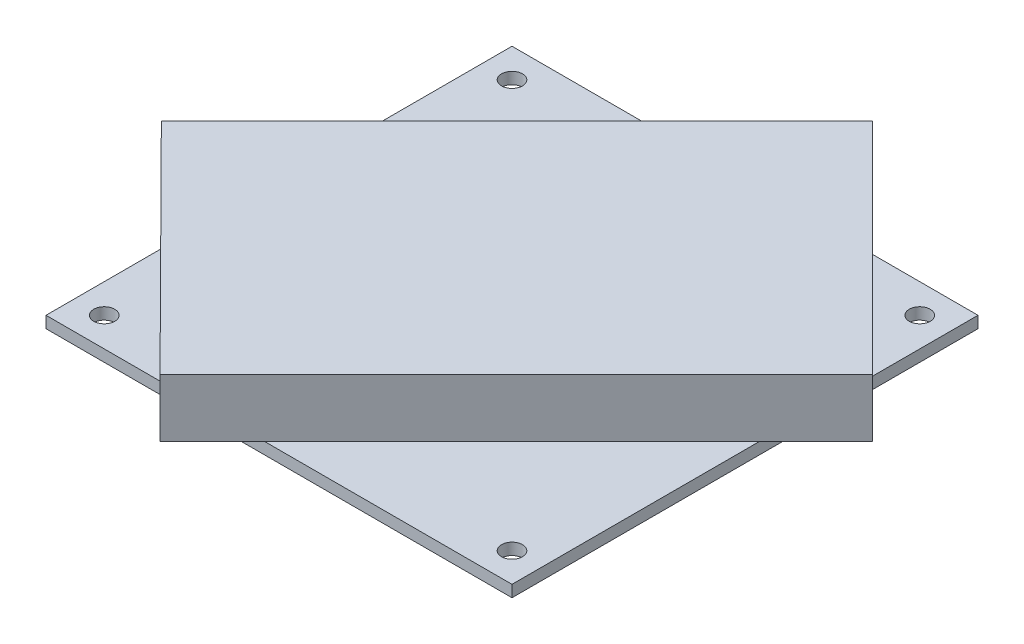
ISO-10303-21;
HEADER;
FILE_DESCRIPTION(('STEP AP214'),'2;1');
FILE_NAME('part.step','',(''),(''),'','','');
FILE_SCHEMA(('AUTOMOTIVE_DESIGN { 1 0 10303 214 1 1 1 1 }'));
ENDSEC;
DATA;
#1=APPLICATION_CONTEXT('core data for automotive mechanical design processes');
#2=APPLICATION_PROTOCOL_DEFINITION('international standard','automotive_design',2000,#1);
#3=PRODUCT_CONTEXT('',#1,'mechanical');
#4=PRODUCT('Part','Part','',(#3));
#5=PRODUCT_RELATED_PRODUCT_CATEGORY('part','',(#4));
#6=PRODUCT_DEFINITION_FORMATION('','',#4);
#7=PRODUCT_DEFINITION_CONTEXT('part definition',#1,'design');
#8=PRODUCT_DEFINITION('design','',#6,#7);
#9=PRODUCT_DEFINITION_SHAPE('','',#8);
#10=(LENGTH_UNIT() NAMED_UNIT(*) SI_UNIT(.MILLI.,.METRE.));
#11=(NAMED_UNIT(*) PLANE_ANGLE_UNIT() SI_UNIT($,.RADIAN.));
#12=(NAMED_UNIT(*) SI_UNIT($,.STERADIAN.) SOLID_ANGLE_UNIT());
#13=UNCERTAINTY_MEASURE_WITH_UNIT(LENGTH_MEASURE(1.E-05),#10,'distance_accuracy_value','');
#14=(GEOMETRIC_REPRESENTATION_CONTEXT(3) GLOBAL_UNCERTAINTY_ASSIGNED_CONTEXT((#13)) GLOBAL_UNIT_ASSIGNED_CONTEXT((#10,
#11,#12)) REPRESENTATION_CONTEXT('',''));
#15=CARTESIAN_POINT('',(0.,0.,0.));
#16=DIRECTION('',(0.,0.,1.));
#17=DIRECTION('',(1.,0.,0.));
#18=AXIS2_PLACEMENT_3D('',#15,#16,#17);
#19=CARTESIAN_POINT('',(0.,2.,0.));
#20=DIRECTION('',(0.,-1.,0.));
#21=DIRECTION('',(0.,0.,-1.));
#22=AXIS2_PLACEMENT_3D('',#19,#20,#21);
#23=PLANE('',#22);
#24=CARTESIAN_POINT('',(5.,2.,-4.99999999999999));
#25=DIRECTION('',(0.,1.,0.));
#26=DIRECTION('',(0.,0.,1.));
#27=AXIS2_PLACEMENT_3D('',#24,#25,#26);
#28=CIRCLE('',#27,1.8);
#29=CARTESIAN_POINT('',(5.,2.,-3.19999999999999));
#30=VERTEX_POINT('',#29);
#31=EDGE_CURVE('E210',#30,#30,#28,.T.);
#32=ORIENTED_EDGE('',*,*,#31,.F.);
#33=EDGE_LOOP('',(#32));
#34=FACE_BOUND('',#33,.T.);
#35=DIRECTION('',(0.705000654457306,0.,0.7092066533915));
#36=VECTOR('',#35,1.);
#37=CARTESIAN_POINT('',(-9.,2.,-28.8007146257669));
#38=LINE('',#37,#36);
#39=CARTESIAN_POINT('',(0.,2.,-19.7470210721958));
#40=VERTEX_POINT('',#39);
#41=CARTESIAN_POINT('',(19.6299100028256,2.,0.));
#42=VERTEX_POINT('',#41);
#43=EDGE_CURVE('E11',#40,#42,#38,.T.);
#44=ORIENTED_EDGE('',*,*,#43,.F.);
#45=DIRECTION('',(0.,0.,1.));
#46=VECTOR('',#45,1.);
#47=CARTESIAN_POINT('',(0.,2.,0.));
#48=LINE('',#47,#46);
#49=CARTESIAN_POINT('',(0.,2.,0.));
#50=VERTEX_POINT('',#49);
#51=EDGE_CURVE('E175',#40,#50,#48,.T.);
#52=ORIENTED_EDGE('',*,*,#51,.T.);
#53=DIRECTION('',(1.,0.,0.));
#54=VECTOR('',#53,1.);
#55=CARTESIAN_POINT('',(0.,2.,0.));
#56=LINE('',#55,#54);
#57=EDGE_CURVE('E176',#50,#42,#56,.T.);
#58=ORIENTED_EDGE('',*,*,#57,.T.);
#59=EDGE_LOOP('',(#44,#52,#58));
#60=FACE_BOUND('',#59,.T.);
#61=ADVANCED_FACE('F33',(#34,#60),#23,.F.);
#62=CARTESIAN_POINT('',(5.,2.,-75.));
#63=DIRECTION('',(0.,1.,0.));
#64=DIRECTION('',(0.,0.,1.));
#65=AXIS2_PLACEMENT_3D('',#62,#63,#64);
#66=CIRCLE('',#65,1.8);
#67=CARTESIAN_POINT('',(5.,2.,-73.2));
#68=VERTEX_POINT('',#67);
#69=EDGE_CURVE('E164',#68,#68,#66,.T.);
#70=ORIENTED_EDGE('',*,*,#69,.F.);
#71=EDGE_LOOP('',(#70));
#72=FACE_BOUND('',#71,.T.);
#73=DIRECTION('',(-0.707106781186546,0.,0.707106781186549));
#74=VECTOR('',#73,1.);
#75=CARTESIAN_POINT('',(-9.,2.,-28.8007146257669));
#76=LINE('',#75,#74);
#77=CARTESIAN_POINT('',(42.1992853742329,2.,-80.));
#78=VERTEX_POINT('',#77);
#79=CARTESIAN_POINT('',(0.,2.,-37.800714625767));
#80=VERTEX_POINT('',#79);
#81=EDGE_CURVE('E42',#78,#80,#76,.T.);
#82=ORIENTED_EDGE('',*,*,#81,.F.);
#83=DIRECTION('',(-1.,0.,0.));
#84=VECTOR('',#83,1.);
#85=CARTESIAN_POINT('',(0.,2.,-80.));
#86=LINE('',#85,#84);
#87=CARTESIAN_POINT('',(0.,2.,-80.));
#88=VERTEX_POINT('',#87);
#89=EDGE_CURVE('E183',#78,#88,#86,.T.);
#90=ORIENTED_EDGE('',*,*,#89,.T.);
#91=EDGE_CURVE('E171',#88,#80,#48,.T.);
#92=ORIENTED_EDGE('',*,*,#91,.T.);
#93=EDGE_LOOP('',(#82,#90,#92));
#94=FACE_BOUND('',#93,.T.);
#95=ADVANCED_FACE('F252',(#72,#94),#23,.F.);
#96=CARTESIAN_POINT('',(75.,2.,-75.));
#97=DIRECTION('',(0.,1.,0.));
#98=DIRECTION('',(0.,0.,1.));
#99=AXIS2_PLACEMENT_3D('',#96,#97,#98);
#100=CIRCLE('',#99,1.8);
#101=CARTESIAN_POINT('',(75.,2.,-73.2));
#102=VERTEX_POINT('',#101);
#103=EDGE_CURVE('E156',#102,#102,#100,.T.);
#104=ORIENTED_EDGE('',*,*,#103,.F.);
#105=EDGE_LOOP('',(#104));
#106=FACE_BOUND('',#105,.T.);
#107=DIRECTION('',(-0.707106781186547,0.,-0.707106781186547));
#108=VECTOR('',#107,1.);
#109=CARTESIAN_POINT('',(52.0233152163989,2.,-89.8240298421661));
#110=LINE('',#109,#108);
#111=CARTESIAN_POINT('',(80.,2.,-61.8473450585651));
#112=VERTEX_POINT('',#111);
#113=CARTESIAN_POINT('',(61.8473450585651,2.,-80.));
#114=VERTEX_POINT('',#113);
#115=EDGE_CURVE('E221',#112,#114,#110,.T.);
#116=ORIENTED_EDGE('',*,*,#115,.F.);
#117=DIRECTION('',(0.,0.,-1.));
#118=VECTOR('',#117,1.);
#119=CARTESIAN_POINT('',(80.,2.,0.));
#120=LINE('',#119,#118);
#121=CARTESIAN_POINT('',(80.,2.,-80.));
#122=VERTEX_POINT('',#121);
#123=EDGE_CURVE('E179',#112,#122,#120,.T.);
#124=ORIENTED_EDGE('',*,*,#123,.T.);
#125=EDGE_CURVE('E185',#122,#114,#86,.T.);
#126=ORIENTED_EDGE('',*,*,#125,.T.);
#127=EDGE_LOOP('',(#116,#124,#126));
#128=FACE_BOUND('',#127,.T.);
#129=ADVANCED_FACE('F303',(#106,#128),#23,.F.);
#130=CARTESIAN_POINT('',(75.,2.,-4.99999999999999));
#131=DIRECTION('',(0.,1.,0.));
#132=DIRECTION('',(0.,0.,1.));
#133=AXIS2_PLACEMENT_3D('',#130,#131,#132);
#134=CIRCLE('',#133,1.8);
#135=CARTESIAN_POINT('',(75.,2.,-3.19999999999999));
#136=VERTEX_POINT('',#135);
#137=EDGE_CURVE('E37',#136,#136,#134,.T.);
#138=ORIENTED_EDGE('',*,*,#137,.F.);
#139=EDGE_LOOP('',(#138));
#140=FACE_BOUND('',#139,.T.);
#141=DIRECTION('',(0.707106781186547,0.,-0.707106781186548));
#142=VECTOR('',#141,1.);
#143=CARTESIAN_POINT('',(28.5765348825744,2.,9.));
#144=LINE('',#143,#142);
#145=CARTESIAN_POINT('',(37.5765348825744,2.,0.));
#146=VERTEX_POINT('',#145);
#147=CARTESIAN_POINT('',(80.,2.,-42.4234651174256));
#148=VERTEX_POINT('',#147);
#149=EDGE_CURVE('E217',#146,#148,#144,.T.);
#150=ORIENTED_EDGE('',*,*,#149,.F.);
#151=CARTESIAN_POINT('',(80.,2.,0.));
#152=VERTEX_POINT('',#151);
#153=EDGE_CURVE('E173',#146,#152,#56,.T.);
#154=ORIENTED_EDGE('',*,*,#153,.T.);
#155=EDGE_CURVE('E181',#152,#148,#120,.T.);
#156=ORIENTED_EDGE('',*,*,#155,.T.);
#157=EDGE_LOOP('',(#150,#154,#156));
#158=FACE_BOUND('',#157,.T.);
#159=ADVANCED_FACE('F282',(#140,#158),#23,.F.);
#160=CARTESIAN_POINT('',(0.,2.,0.));
#161=DIRECTION('',(1.,0.,0.));
#162=DIRECTION('',(0.,0.,-1.));
#163=AXIS2_PLACEMENT_3D('',#160,#161,#162);
#164=PLANE('',#163);
#165=DIRECTION('',(0.,0.,1.));
#166=VECTOR('',#165,1.);
#167=CARTESIAN_POINT('',(0.,0.,0.));
#168=LINE('',#167,#166);
#169=CARTESIAN_POINT('',(0.,0.,-80.));
#170=VERTEX_POINT('',#169);
#171=CARTESIAN_POINT('',(0.,0.,0.));
#172=VERTEX_POINT('',#171);
#173=EDGE_CURVE('E168',#170,#172,#168,.T.);
#174=ORIENTED_EDGE('',*,*,#173,.T.);
#175=DIRECTION('',(0.,-1.,0.));
#176=VECTOR('',#175,1.);
#177=CARTESIAN_POINT('',(0.,2.,0.));
#178=LINE('',#177,#176);
#179=EDGE_CURVE('E204',#50,#172,#178,.T.);
#180=ORIENTED_EDGE('',*,*,#179,.F.);
#181=ORIENTED_EDGE('',*,*,#51,.F.);
#182=EDGE_CURVE('E174',#80,#40,#48,.T.);
#183=ORIENTED_EDGE('',*,*,#182,.F.);
#184=ORIENTED_EDGE('',*,*,#91,.F.);
#185=DIRECTION('',(0.,-1.,0.));
#186=VECTOR('',#185,1.);
#187=CARTESIAN_POINT('',(0.,2.,-80.));
#188=LINE('',#187,#186);
#189=EDGE_CURVE('E187',#88,#170,#188,.T.);
#190=ORIENTED_EDGE('',*,*,#189,.T.);
#191=EDGE_LOOP('',(#174,#180,#181,#183,#184,#190));
#192=FACE_BOUND('',#191,.T.);
#193=ADVANCED_FACE('F258',(#192),#164,.F.);
#194=CARTESIAN_POINT('',(0.,2.,0.));
#195=DIRECTION('',(0.,0.,-1.));
#196=DIRECTION('',(-1.,0.,0.));
#197=AXIS2_PLACEMENT_3D('',#194,#195,#196);
#198=PLANE('',#197);
#199=DIRECTION('',(1.,0.,0.));
#200=VECTOR('',#199,1.);
#201=CARTESIAN_POINT('',(0.,0.,0.));
#202=LINE('',#201,#200);
#203=CARTESIAN_POINT('',(80.,0.,0.));
#204=VERTEX_POINT('',#203);
#205=EDGE_CURVE('E190',#172,#204,#202,.T.);
#206=ORIENTED_EDGE('',*,*,#205,.T.);
#207=DIRECTION('',(0.,-1.,0.));
#208=VECTOR('',#207,1.);
#209=CARTESIAN_POINT('',(80.,2.,0.));
#210=LINE('',#209,#208);
#211=EDGE_CURVE('E201',#152,#204,#210,.T.);
#212=ORIENTED_EDGE('',*,*,#211,.F.);
#213=ORIENTED_EDGE('',*,*,#153,.F.);
#214=EDGE_CURVE('E180',#42,#146,#56,.T.);
#215=ORIENTED_EDGE('',*,*,#214,.F.);
#216=ORIENTED_EDGE('',*,*,#57,.F.);
#217=ORIENTED_EDGE('',*,*,#179,.T.);
#218=EDGE_LOOP('',(#206,#212,#213,#215,#216,#217));
#219=FACE_BOUND('',#218,.T.);
#220=ADVANCED_FACE('F266',(#219),#198,.F.);
#221=CARTESIAN_POINT('',(80.,2.,0.));
#222=DIRECTION('',(-1.,0.,0.));
#223=DIRECTION('',(0.,0.,1.));
#224=AXIS2_PLACEMENT_3D('',#221,#222,#223);
#225=PLANE('',#224);
#226=DIRECTION('',(0.,0.,-1.));
#227=VECTOR('',#226,1.);
#228=CARTESIAN_POINT('',(80.,0.,0.));
#229=LINE('',#228,#227);
#230=CARTESIAN_POINT('',(80.,0.,-80.));
#231=VERTEX_POINT('',#230);
#232=EDGE_CURVE('E192',#204,#231,#229,.T.);
#233=ORIENTED_EDGE('',*,*,#232,.T.);
#234=DIRECTION('',(0.,-1.,0.));
#235=VECTOR('',#234,1.);
#236=CARTESIAN_POINT('',(80.,2.,-80.));
#237=LINE('',#236,#235);
#238=EDGE_CURVE('E198',#122,#231,#237,.T.);
#239=ORIENTED_EDGE('',*,*,#238,.F.);
#240=ORIENTED_EDGE('',*,*,#123,.F.);
#241=EDGE_CURVE('E184',#148,#112,#120,.T.);
#242=ORIENTED_EDGE('',*,*,#241,.F.);
#243=ORIENTED_EDGE('',*,*,#155,.F.);
#244=ORIENTED_EDGE('',*,*,#211,.T.);
#245=EDGE_LOOP('',(#233,#239,#240,#242,#243,#244));
#246=FACE_BOUND('',#245,.T.);
#247=ADVANCED_FACE('F276',(#246),#225,.F.);
#248=CARTESIAN_POINT('',(0.,2.,-80.));
#249=DIRECTION('',(0.,0.,1.));
#250=DIRECTION('',(1.,0.,0.));
#251=AXIS2_PLACEMENT_3D('',#248,#249,#250);
#252=PLANE('',#251);
#253=DIRECTION('',(-1.,0.,0.));
#254=VECTOR('',#253,1.);
#255=CARTESIAN_POINT('',(0.,0.,-80.));
#256=LINE('',#255,#254);
#257=EDGE_CURVE('E194',#231,#170,#256,.T.);
#258=ORIENTED_EDGE('',*,*,#257,.T.);
#259=ORIENTED_EDGE('',*,*,#189,.F.);
#260=ORIENTED_EDGE('',*,*,#89,.F.);
#261=EDGE_CURVE('E58',#114,#78,#86,.T.);
#262=ORIENTED_EDGE('',*,*,#261,.F.);
#263=ORIENTED_EDGE('',*,*,#125,.F.);
#264=ORIENTED_EDGE('',*,*,#238,.T.);
#265=EDGE_LOOP('',(#258,#259,#260,#262,#263,#264));
#266=FACE_BOUND('',#265,.T.);
#267=ADVANCED_FACE('F254',(#266),#252,.F.);
#268=CARTESIAN_POINT('',(0.,0.,0.));
#269=DIRECTION('',(0.,-1.,0.));
#270=DIRECTION('',(0.,0.,-1.));
#271=AXIS2_PLACEMENT_3D('',#268,#269,#270);
#272=PLANE('',#271);
#273=CARTESIAN_POINT('',(75.,0.,-75.));
#274=DIRECTION('',(0.,1.,0.));
#275=DIRECTION('',(0.,0.,1.));
#276=AXIS2_PLACEMENT_3D('',#273,#274,#275);
#277=CIRCLE('',#276,1.8);
#278=CARTESIAN_POINT('',(75.,0.,-73.2));
#279=VERTEX_POINT('',#278);
#280=EDGE_CURVE('E153',#279,#279,#277,.T.);
#281=ORIENTED_EDGE('',*,*,#280,.T.);
#282=EDGE_LOOP('',(#281));
#283=FACE_BOUND('',#282,.T.);
#284=CARTESIAN_POINT('',(5.,0.,-75.));
#285=DIRECTION('',(0.,1.,0.));
#286=DIRECTION('',(0.,0.,1.));
#287=AXIS2_PLACEMENT_3D('',#284,#285,#286);
#288=CIRCLE('',#287,1.8);
#289=CARTESIAN_POINT('',(5.,0.,-73.2));
#290=VERTEX_POINT('',#289);
#291=EDGE_CURVE('E165',#290,#290,#288,.T.);
#292=ORIENTED_EDGE('',*,*,#291,.T.);
#293=EDGE_LOOP('',(#292));
#294=FACE_BOUND('',#293,.T.);
#295=ORIENTED_EDGE('',*,*,#173,.F.);
#296=ORIENTED_EDGE('',*,*,#257,.F.);
#297=ORIENTED_EDGE('',*,*,#232,.F.);
#298=ORIENTED_EDGE('',*,*,#205,.F.);
#299=EDGE_LOOP('',(#295,#296,#297,#298));
#300=FACE_BOUND('',#299,.T.);
#301=CARTESIAN_POINT('',(5.,0.,-4.99999999999999));
#302=DIRECTION('',(0.,1.,0.));
#303=DIRECTION('',(0.,0.,1.));
#304=AXIS2_PLACEMENT_3D('',#301,#302,#303);
#305=CIRCLE('',#304,1.8);
#306=CARTESIAN_POINT('',(5.,0.,-3.19999999999999));
#307=VERTEX_POINT('',#306);
#308=EDGE_CURVE('E207',#307,#307,#305,.T.);
#309=ORIENTED_EDGE('',*,*,#308,.T.);
#310=EDGE_LOOP('',(#309));
#311=FACE_BOUND('',#310,.T.);
#312=CARTESIAN_POINT('',(75.,0.,-4.99999999999999));
#313=DIRECTION('',(0.,1.,0.));
#314=DIRECTION('',(0.,0.,1.));
#315=AXIS2_PLACEMENT_3D('',#312,#313,#314);
#316=CIRCLE('',#315,1.8);
#317=CARTESIAN_POINT('',(75.,0.,-3.19999999999999));
#318=VERTEX_POINT('',#317);
#319=EDGE_CURVE('E212',#318,#318,#316,.T.);
#320=ORIENTED_EDGE('',*,*,#319,.T.);
#321=EDGE_LOOP('',(#320));
#322=FACE_BOUND('',#321,.T.);
#323=ADVANCED_FACE('F270',(#283,#294,#300,#311,#322),#272,.T.);
#324=CARTESIAN_POINT('',(5.,0.,-75.));
#325=DIRECTION('',(0.,1.,0.));
#326=DIRECTION('',(0.,0.,1.));
#327=AXIS2_PLACEMENT_3D('',#324,#325,#326);
#328=CYLINDRICAL_SURFACE('',#327,1.8);
#329=ORIENTED_EDGE('',*,*,#291,.F.);
#330=EDGE_LOOP('',(#329));
#331=FACE_BOUND('',#330,.T.);
#332=ORIENTED_EDGE('',*,*,#69,.T.);
#333=EDGE_LOOP('',(#332));
#334=FACE_BOUND('',#333,.T.);
#335=ADVANCED_FACE('F324',(#331,#334),#328,.F.);
#336=CARTESIAN_POINT('',(75.,0.,-75.));
#337=DIRECTION('',(0.,1.,0.));
#338=DIRECTION('',(0.,0.,1.));
#339=AXIS2_PLACEMENT_3D('',#336,#337,#338);
#340=CYLINDRICAL_SURFACE('',#339,1.8);
#341=ORIENTED_EDGE('',*,*,#280,.F.);
#342=EDGE_LOOP('',(#341));
#343=FACE_BOUND('',#342,.T.);
#344=ORIENTED_EDGE('',*,*,#103,.T.);
#345=EDGE_LOOP('',(#344));
#346=FACE_BOUND('',#345,.T.);
#347=ADVANCED_FACE('F321',(#343,#346),#340,.F.);
#348=CARTESIAN_POINT('',(5.,0.,-4.99999999999999));
#349=DIRECTION('',(0.,1.,0.));
#350=DIRECTION('',(0.,0.,1.));
#351=AXIS2_PLACEMENT_3D('',#348,#349,#350);
#352=CYLINDRICAL_SURFACE('',#351,1.8);
#353=ORIENTED_EDGE('',*,*,#308,.F.);
#354=EDGE_LOOP('',(#353));
#355=FACE_BOUND('',#354,.T.);
#356=ORIENTED_EDGE('',*,*,#31,.T.);
#357=EDGE_LOOP('',(#356));
#358=FACE_BOUND('',#357,.T.);
#359=ADVANCED_FACE('F323',(#355,#358),#352,.F.);
#360=CARTESIAN_POINT('',(75.,0.,-4.99999999999999));
#361=DIRECTION('',(0.,1.,0.));
#362=DIRECTION('',(0.,0.,1.));
#363=AXIS2_PLACEMENT_3D('',#360,#361,#362);
#364=CYLINDRICAL_SURFACE('',#363,1.8);
#365=ORIENTED_EDGE('',*,*,#319,.F.);
#366=EDGE_LOOP('',(#365));
#367=FACE_BOUND('',#366,.T.);
#368=ORIENTED_EDGE('',*,*,#137,.T.);
#369=EDGE_LOOP('',(#368));
#370=FACE_BOUND('',#369,.T.);
#371=ADVANCED_FACE('F35',(#367,#370),#364,.F.);
#372=CARTESIAN_POINT('',(0.,2.,0.));
#373=DIRECTION('',(0.,1.,0.));
#374=DIRECTION('',(0.,0.,1.));
#375=AXIS2_PLACEMENT_3D('',#372,#373,#374);
#376=PLANE('',#375);
#377=CARTESIAN_POINT('',(-9.,2.,-28.8007146257669));
#378=VERTEX_POINT('',#377);
#379=EDGE_CURVE('E245',#80,#378,#76,.T.);
#380=ORIENTED_EDGE('',*,*,#379,.F.);
#381=ORIENTED_EDGE('',*,*,#182,.T.);
#382=EDGE_CURVE('E44',#378,#40,#38,.T.);
#383=ORIENTED_EDGE('',*,*,#382,.F.);
#384=EDGE_LOOP('',(#380,#381,#383));
#385=FACE_BOUND('',#384,.T.);
#386=ADVANCED_FACE('F287',(#385),#376,.F.);
#387=CARTESIAN_POINT('',(28.5765348825744,2.,9.));
#388=VERTEX_POINT('',#387);
#389=EDGE_CURVE('E45',#42,#388,#38,.T.);
#390=ORIENTED_EDGE('',*,*,#389,.F.);
#391=ORIENTED_EDGE('',*,*,#214,.T.);
#392=EDGE_CURVE('E223',#388,#146,#144,.T.);
#393=ORIENTED_EDGE('',*,*,#392,.F.);
#394=EDGE_LOOP('',(#390,#391,#393));
#395=FACE_BOUND('',#394,.T.);
#396=ADVANCED_FACE('F284',(#395),#376,.F.);
#397=CARTESIAN_POINT('',(89.7119399705697,2.,-52.1354050879953));
#398=VERTEX_POINT('',#397);
#399=EDGE_CURVE('E224',#148,#398,#144,.T.);
#400=ORIENTED_EDGE('',*,*,#399,.F.);
#401=ORIENTED_EDGE('',*,*,#241,.T.);
#402=EDGE_CURVE('E227',#398,#112,#110,.T.);
#403=ORIENTED_EDGE('',*,*,#402,.F.);
#404=EDGE_LOOP('',(#400,#401,#403));
#405=FACE_BOUND('',#404,.T.);
#406=ADVANCED_FACE('F286',(#405),#376,.F.);
#407=CARTESIAN_POINT('',(52.0233152163989,2.,-89.8240298421661));
#408=VERTEX_POINT('',#407);
#409=EDGE_CURVE('E228',#114,#408,#110,.T.);
#410=ORIENTED_EDGE('',*,*,#409,.F.);
#411=ORIENTED_EDGE('',*,*,#261,.T.);
#412=EDGE_CURVE('E147',#408,#78,#76,.T.);
#413=ORIENTED_EDGE('',*,*,#412,.F.);
#414=EDGE_LOOP('',(#410,#411,#413));
#415=FACE_BOUND('',#414,.T.);
#416=ADVANCED_FACE('F250',(#415),#376,.F.);
#417=CARTESIAN_POINT('',(-9.,12.,-28.8007146257669));
#418=DIRECTION('',(0.7092066533915,0.,-0.705000654457306));
#419=DIRECTION('',(-0.705000654457306,0.,-0.7092066533915));
#420=AXIS2_PLACEMENT_3D('',#417,#418,#419);
#421=PLANE('',#420);
#422=ORIENTED_EDGE('',*,*,#382,.T.);
#423=ORIENTED_EDGE('',*,*,#43,.T.);
#424=ORIENTED_EDGE('',*,*,#389,.T.);
#425=DIRECTION('',(0.,-1.,0.));
#426=VECTOR('',#425,1.);
#427=CARTESIAN_POINT('',(28.5765348825744,12.,9.));
#428=LINE('',#427,#426);
#429=CARTESIAN_POINT('',(28.5765348825744,12.,9.));
#430=VERTEX_POINT('',#429);
#431=EDGE_CURVE('E132',#430,#388,#428,.T.);
#432=ORIENTED_EDGE('',*,*,#431,.F.);
#433=DIRECTION('',(0.705000654457306,0.,0.7092066533915));
#434=VECTOR('',#433,1.);
#435=CARTESIAN_POINT('',(-9.,12.,-28.8007146257669));
#436=LINE('',#435,#434);
#437=CARTESIAN_POINT('',(-9.,12.,-28.8007146257669));
#438=VERTEX_POINT('',#437);
#439=EDGE_CURVE('E138',#438,#430,#436,.T.);
#440=ORIENTED_EDGE('',*,*,#439,.F.);
#441=DIRECTION('',(0.,-1.,0.));
#442=VECTOR('',#441,1.);
#443=CARTESIAN_POINT('',(-9.,12.,-28.8007146257669));
#444=LINE('',#443,#442);
#445=EDGE_CURVE('E233',#438,#378,#444,.T.);
#446=ORIENTED_EDGE('',*,*,#445,.T.);
#447=EDGE_LOOP('',(#422,#423,#424,#432,#440,#446));
#448=FACE_BOUND('',#447,.T.);
#449=ADVANCED_FACE('F150',(#448),#421,.F.);
#450=CARTESIAN_POINT('',(28.5765348825744,12.,9.));
#451=DIRECTION('',(-0.707106781186548,0.,-0.707106781186547));
#452=DIRECTION('',(-0.707106781186547,0.,0.707106781186548));
#453=AXIS2_PLACEMENT_3D('',#450,#451,#452);
#454=PLANE('',#453);
#455=ORIENTED_EDGE('',*,*,#392,.T.);
#456=ORIENTED_EDGE('',*,*,#149,.T.);
#457=ORIENTED_EDGE('',*,*,#399,.T.);
#458=DIRECTION('',(0.,-1.,0.));
#459=VECTOR('',#458,1.);
#460=CARTESIAN_POINT('',(89.7119399705697,12.,-52.1354050879953));
#461=LINE('',#460,#459);
#462=CARTESIAN_POINT('',(89.7119399705697,12.,-52.1354050879953));
#463=VERTEX_POINT('',#462);
#464=EDGE_CURVE('E134',#463,#398,#461,.T.);
#465=ORIENTED_EDGE('',*,*,#464,.F.);
#466=DIRECTION('',(0.707106781186547,0.,-0.707106781186548));
#467=VECTOR('',#466,1.);
#468=CARTESIAN_POINT('',(28.5765348825744,12.,9.));
#469=LINE('',#468,#467);
#470=EDGE_CURVE('E127',#430,#463,#469,.T.);
#471=ORIENTED_EDGE('',*,*,#470,.F.);
#472=ORIENTED_EDGE('',*,*,#431,.T.);
#473=EDGE_LOOP('',(#455,#456,#457,#465,#471,#472));
#474=FACE_BOUND('',#473,.T.);
#475=ADVANCED_FACE('F130',(#474),#454,.F.);
#476=CARTESIAN_POINT('',(52.0233152163989,12.,-89.8240298421661));
#477=DIRECTION('',(-0.707106781186548,0.,0.707106781186547));
#478=DIRECTION('',(0.707106781186547,0.,0.707106781186548));
#479=AXIS2_PLACEMENT_3D('',#476,#477,#478);
#480=PLANE('',#479);
#481=ORIENTED_EDGE('',*,*,#402,.T.);
#482=ORIENTED_EDGE('',*,*,#115,.T.);
#483=ORIENTED_EDGE('',*,*,#409,.T.);
#484=DIRECTION('',(0.,-1.,0.));
#485=VECTOR('',#484,1.);
#486=CARTESIAN_POINT('',(52.0233152163989,12.,-89.8240298421661));
#487=LINE('',#486,#485);
#488=CARTESIAN_POINT('',(52.0233152163989,12.,-89.8240298421661));
#489=VERTEX_POINT('',#488);
#490=EDGE_CURVE('E158',#489,#408,#487,.T.);
#491=ORIENTED_EDGE('',*,*,#490,.F.);
#492=DIRECTION('',(-0.707106781186547,0.,-0.707106781186547));
#493=VECTOR('',#492,1.);
#494=CARTESIAN_POINT('',(52.0233152163989,12.,-89.8240298421661));
#495=LINE('',#494,#493);
#496=EDGE_CURVE('E137',#463,#489,#495,.T.);
#497=ORIENTED_EDGE('',*,*,#496,.F.);
#498=ORIENTED_EDGE('',*,*,#464,.T.);
#499=EDGE_LOOP('',(#481,#482,#483,#491,#497,#498));
#500=FACE_BOUND('',#499,.T.);
#501=ADVANCED_FACE('F238',(#500),#480,.F.);
#502=CARTESIAN_POINT('',(-9.,12.,-28.8007146257669));
#503=DIRECTION('',(0.707106781186549,0.,0.707106781186546));
#504=DIRECTION('',(0.707106781186546,0.,-0.707106781186549));
#505=AXIS2_PLACEMENT_3D('',#502,#503,#504);
#506=PLANE('',#505);
#507=ORIENTED_EDGE('',*,*,#412,.T.);
#508=ORIENTED_EDGE('',*,*,#81,.T.);
#509=ORIENTED_EDGE('',*,*,#379,.T.);
#510=ORIENTED_EDGE('',*,*,#445,.F.);
#511=DIRECTION('',(-0.707106781186546,0.,0.707106781186549));
#512=VECTOR('',#511,1.);
#513=CARTESIAN_POINT('',(-9.,12.,-28.8007146257669));
#514=LINE('',#513,#512);
#515=EDGE_CURVE('E143',#489,#438,#514,.T.);
#516=ORIENTED_EDGE('',*,*,#515,.F.);
#517=ORIENTED_EDGE('',*,*,#490,.T.);
#518=EDGE_LOOP('',(#507,#508,#509,#510,#516,#517));
#519=FACE_BOUND('',#518,.T.);
#520=ADVANCED_FACE('F243',(#519),#506,.F.);
#521=CARTESIAN_POINT('',(0.,12.,0.));
#522=DIRECTION('',(0.,1.,0.));
#523=DIRECTION('',(0.,0.,1.));
#524=AXIS2_PLACEMENT_3D('',#521,#522,#523);
#525=PLANE('',#524);
#526=ORIENTED_EDGE('',*,*,#439,.T.);
#527=ORIENTED_EDGE('',*,*,#470,.T.);
#528=ORIENTED_EDGE('',*,*,#496,.T.);
#529=ORIENTED_EDGE('',*,*,#515,.T.);
#530=EDGE_LOOP('',(#526,#527,#528,#529));
#531=FACE_BOUND('',#530,.T.);
#532=ADVANCED_FACE('F141',(#531),#525,.T.);
#533=CLOSED_SHELL('',(#61,#95,#129,#159,#193,#220,#247,#267,#323,#335,#347,#359,#371,#386,#396,
#406,#416,#449,#475,#501,#520,#532));
#534=MANIFOLD_SOLID_BREP('B2',#533);
#535=ADVANCED_BREP_SHAPE_REPRESENTATION('',(#18,#534),#14);
#536=SHAPE_DEFINITION_REPRESENTATION(#9,#535);
ENDSEC;
END-ISO-10303-21;
